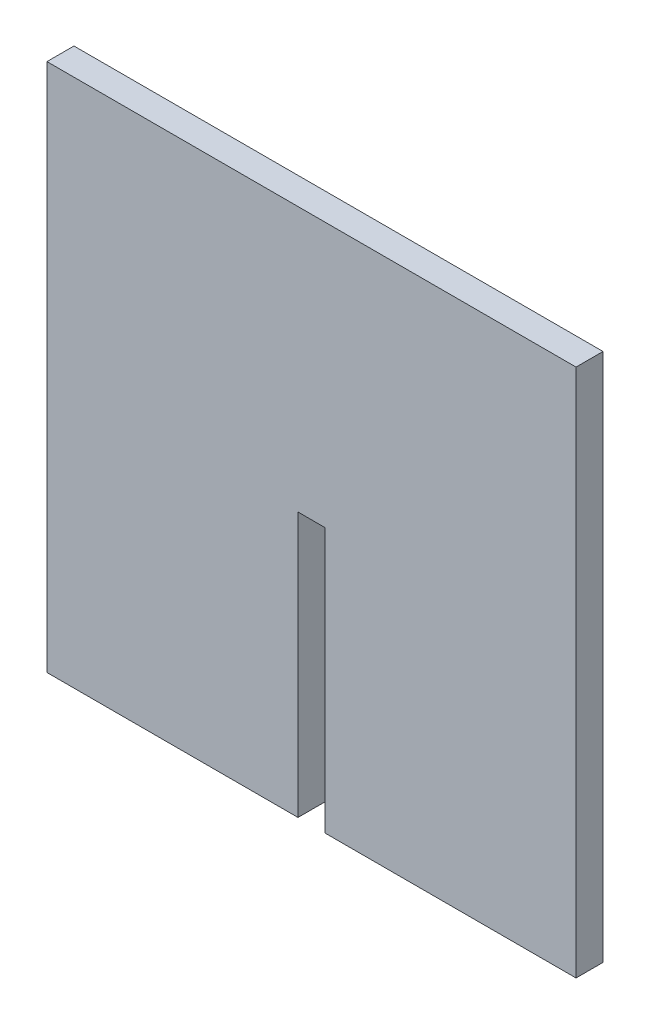
ISO-10303-21;
HEADER;
FILE_DESCRIPTION(('STEP AP214'),'2;1');
FILE_NAME('part.step','',(''),(''),'','','');
FILE_SCHEMA(('AUTOMOTIVE_DESIGN { 1 0 10303 214 1 1 1 1 }'));
ENDSEC;
DATA;
#1=APPLICATION_CONTEXT('core data for automotive mechanical design processes');
#2=APPLICATION_PROTOCOL_DEFINITION('international standard','automotive_design',2000,#1);
#3=PRODUCT_CONTEXT('',#1,'mechanical');
#4=PRODUCT('Part','Part','',(#3));
#5=PRODUCT_RELATED_PRODUCT_CATEGORY('part','',(#4));
#6=PRODUCT_DEFINITION_FORMATION('','',#4);
#7=PRODUCT_DEFINITION_CONTEXT('part definition',#1,'design');
#8=PRODUCT_DEFINITION('design','',#6,#7);
#9=PRODUCT_DEFINITION_SHAPE('','',#8);
#10=(LENGTH_UNIT() NAMED_UNIT(*) SI_UNIT(.MILLI.,.METRE.));
#11=(NAMED_UNIT(*) PLANE_ANGLE_UNIT() SI_UNIT($,.RADIAN.));
#12=(NAMED_UNIT(*) SI_UNIT($,.STERADIAN.) SOLID_ANGLE_UNIT());
#13=UNCERTAINTY_MEASURE_WITH_UNIT(LENGTH_MEASURE(1.E-05),#10,'distance_accuracy_value','');
#14=(GEOMETRIC_REPRESENTATION_CONTEXT(3) GLOBAL_UNCERTAINTY_ASSIGNED_CONTEXT((#13)) GLOBAL_UNIT_ASSIGNED_CONTEXT((#10,
#11,#12)) REPRESENTATION_CONTEXT('',''));
#15=CARTESIAN_POINT('',(0.,0.,0.));
#16=DIRECTION('',(0.,0.,1.));
#17=DIRECTION('',(1.,0.,0.));
#18=AXIS2_PLACEMENT_3D('',#15,#16,#17);
#19=CARTESIAN_POINT('',(0.,0.,4.318));
#20=DIRECTION('',(1.,0.,0.));
#21=DIRECTION('',(0.,0.,-1.));
#22=AXIS2_PLACEMENT_3D('',#19,#20,#21);
#23=PLANE('',#22);
#24=DIRECTION('',(0.,-1.,0.));
#25=VECTOR('',#24,1.);
#26=CARTESIAN_POINT('',(0.,0.,0.));
#27=LINE('',#26,#25);
#28=CARTESIAN_POINT('',(0.,84.6,0.));
#29=VERTEX_POINT('',#28);
#30=CARTESIAN_POINT('',(0.,0.,0.));
#31=VERTEX_POINT('',#30);
#32=EDGE_CURVE('E129',#29,#31,#27,.T.);
#33=ORIENTED_EDGE('',*,*,#32,.T.);
#34=DIRECTION('',(0.,0.,-1.));
#35=VECTOR('',#34,1.);
#36=CARTESIAN_POINT('',(0.,0.,4.318));
#37=LINE('',#36,#35);
#38=CARTESIAN_POINT('',(0.,0.,4.318));
#39=VERTEX_POINT('',#38);
#40=EDGE_CURVE('E11',#39,#31,#37,.T.);
#41=ORIENTED_EDGE('',*,*,#40,.F.);
#42=DIRECTION('',(0.,-1.,0.));
#43=VECTOR('',#42,1.);
#44=CARTESIAN_POINT('',(0.,0.,4.318));
#45=LINE('',#44,#43);
#46=CARTESIAN_POINT('',(0.,84.6,4.318));
#47=VERTEX_POINT('',#46);
#48=EDGE_CURVE('E143',#47,#39,#45,.T.);
#49=ORIENTED_EDGE('',*,*,#48,.F.);
#50=DIRECTION('',(0.,0.,-1.));
#51=VECTOR('',#50,1.);
#52=CARTESIAN_POINT('',(0.,84.6,4.318));
#53=LINE('',#52,#51);
#54=EDGE_CURVE('E125',#47,#29,#53,.T.);
#55=ORIENTED_EDGE('',*,*,#54,.T.);
#56=EDGE_LOOP('',(#33,#41,#49,#55));
#57=FACE_BOUND('',#56,.T.);
#58=ADVANCED_FACE('F33',(#57),#23,.F.);
#59=CARTESIAN_POINT('',(0.,0.,4.318));
#60=DIRECTION('',(0.,1.,0.));
#61=DIRECTION('',(0.,0.,1.));
#62=AXIS2_PLACEMENT_3D('',#59,#60,#61);
#63=PLANE('',#62);
#64=DIRECTION('',(1.,0.,0.));
#65=VECTOR('',#64,1.);
#66=CARTESIAN_POINT('',(0.,0.,0.));
#67=LINE('',#66,#65);
#68=CARTESIAN_POINT('',(40.141,0.,0.));
#69=VERTEX_POINT('',#68);
#70=EDGE_CURVE('E132',#31,#69,#67,.T.);
#71=ORIENTED_EDGE('',*,*,#70,.T.);
#72=DIRECTION('',(0.,0.,-1.));
#73=VECTOR('',#72,1.);
#74=CARTESIAN_POINT('',(40.141,0.,4.318));
#75=LINE('',#74,#73);
#76=CARTESIAN_POINT('',(40.141,0.,4.318));
#77=VERTEX_POINT('',#76);
#78=EDGE_CURVE('E41',#77,#69,#75,.T.);
#79=ORIENTED_EDGE('',*,*,#78,.F.);
#80=DIRECTION('',(1.,0.,0.));
#81=VECTOR('',#80,1.);
#82=CARTESIAN_POINT('',(0.,0.,4.318));
#83=LINE('',#82,#81);
#84=EDGE_CURVE('E92',#39,#77,#83,.T.);
#85=ORIENTED_EDGE('',*,*,#84,.F.);
#86=ORIENTED_EDGE('',*,*,#40,.T.);
#87=EDGE_LOOP('',(#71,#79,#85,#86));
#88=FACE_BOUND('',#87,.T.);
#89=ADVANCED_FACE('F178',(#88),#63,.F.);
#90=CARTESIAN_POINT('',(40.141,0.,4.318));
#91=DIRECTION('',(-1.,0.,0.));
#92=DIRECTION('',(0.,0.,1.));
#93=AXIS2_PLACEMENT_3D('',#90,#91,#92);
#94=PLANE('',#93);
#95=DIRECTION('',(0.,1.,0.));
#96=VECTOR('',#95,1.);
#97=CARTESIAN_POINT('',(40.141,0.,0.));
#98=LINE('',#97,#96);
#99=CARTESIAN_POINT('',(40.141,42.3,0.));
#100=VERTEX_POINT('',#99);
#101=EDGE_CURVE('E134',#69,#100,#98,.T.);
#102=ORIENTED_EDGE('',*,*,#101,.T.);
#103=DIRECTION('',(0.,0.,-1.));
#104=VECTOR('',#103,1.);
#105=CARTESIAN_POINT('',(40.141,42.3,4.318));
#106=LINE('',#105,#104);
#107=CARTESIAN_POINT('',(40.141,42.3,4.318));
#108=VERTEX_POINT('',#107);
#109=EDGE_CURVE('E150',#108,#100,#106,.T.);
#110=ORIENTED_EDGE('',*,*,#109,.F.);
#111=DIRECTION('',(0.,1.,0.));
#112=VECTOR('',#111,1.);
#113=CARTESIAN_POINT('',(40.141,0.,4.318));
#114=LINE('',#113,#112);
#115=EDGE_CURVE('E158',#77,#108,#114,.T.);
#116=ORIENTED_EDGE('',*,*,#115,.F.);
#117=ORIENTED_EDGE('',*,*,#78,.T.);
#118=EDGE_LOOP('',(#102,#110,#116,#117));
#119=FACE_BOUND('',#118,.T.);
#120=ADVANCED_FACE('F156',(#119),#94,.F.);
#121=CARTESIAN_POINT('',(40.141,42.3,4.318));
#122=DIRECTION('',(0.,1.,0.));
#123=DIRECTION('',(0.,0.,1.));
#124=AXIS2_PLACEMENT_3D('',#121,#122,#123);
#125=PLANE('',#124);
#126=DIRECTION('',(1.,0.,0.));
#127=VECTOR('',#126,1.);
#128=CARTESIAN_POINT('',(40.141,42.3,0.));
#129=LINE('',#128,#127);
#130=CARTESIAN_POINT('',(44.459,42.3,0.));
#131=VERTEX_POINT('',#130);
#132=EDGE_CURVE('E136',#100,#131,#129,.T.);
#133=ORIENTED_EDGE('',*,*,#132,.T.);
#134=DIRECTION('',(0.,0.,-1.));
#135=VECTOR('',#134,1.);
#136=CARTESIAN_POINT('',(44.459,42.3,4.318));
#137=LINE('',#136,#135);
#138=CARTESIAN_POINT('',(44.459,42.3,4.318));
#139=VERTEX_POINT('',#138);
#140=EDGE_CURVE('E147',#139,#131,#137,.T.);
#141=ORIENTED_EDGE('',*,*,#140,.F.);
#142=DIRECTION('',(1.,0.,0.));
#143=VECTOR('',#142,1.);
#144=CARTESIAN_POINT('',(40.141,42.3,4.318));
#145=LINE('',#144,#143);
#146=EDGE_CURVE('E170',#108,#139,#145,.T.);
#147=ORIENTED_EDGE('',*,*,#146,.F.);
#148=ORIENTED_EDGE('',*,*,#109,.T.);
#149=EDGE_LOOP('',(#133,#141,#147,#148));
#150=FACE_BOUND('',#149,.T.);
#151=ADVANCED_FACE('F166',(#150),#125,.F.);
#152=CARTESIAN_POINT('',(44.459,0.,4.318));
#153=DIRECTION('',(1.,0.,0.));
#154=DIRECTION('',(0.,0.,-1.));
#155=AXIS2_PLACEMENT_3D('',#152,#153,#154);
#156=PLANE('',#155);
#157=DIRECTION('',(0.,-1.,0.));
#158=VECTOR('',#157,1.);
#159=CARTESIAN_POINT('',(44.459,0.,0.));
#160=LINE('',#159,#158);
#161=CARTESIAN_POINT('',(44.459,0.,0.));
#162=VERTEX_POINT('',#161);
#163=EDGE_CURVE('E138',#131,#162,#160,.T.);
#164=ORIENTED_EDGE('',*,*,#163,.T.);
#165=DIRECTION('',(0.,0.,-1.));
#166=VECTOR('',#165,1.);
#167=CARTESIAN_POINT('',(44.459,0.,4.318));
#168=LINE('',#167,#166);
#169=CARTESIAN_POINT('',(44.459,0.,4.318));
#170=VERTEX_POINT('',#169);
#171=EDGE_CURVE('E120',#170,#162,#168,.T.);
#172=ORIENTED_EDGE('',*,*,#171,.F.);
#173=DIRECTION('',(0.,-1.,0.));
#174=VECTOR('',#173,1.);
#175=CARTESIAN_POINT('',(44.459,0.,4.318));
#176=LINE('',#175,#174);
#177=EDGE_CURVE('E111',#139,#170,#176,.T.);
#178=ORIENTED_EDGE('',*,*,#177,.F.);
#179=ORIENTED_EDGE('',*,*,#140,.T.);
#180=EDGE_LOOP('',(#164,#172,#178,#179));
#181=FACE_BOUND('',#180,.T.);
#182=ADVANCED_FACE('F169',(#181),#156,.F.);
#183=CARTESIAN_POINT('',(44.459,0.,4.318));
#184=DIRECTION('',(0.,1.,0.));
#185=DIRECTION('',(0.,0.,1.));
#186=AXIS2_PLACEMENT_3D('',#183,#184,#185);
#187=PLANE('',#186);
#188=DIRECTION('',(1.,0.,0.));
#189=VECTOR('',#188,1.);
#190=CARTESIAN_POINT('',(44.459,0.,0.));
#191=LINE('',#190,#189);
#192=CARTESIAN_POINT('',(84.6,0.,0.));
#193=VERTEX_POINT('',#192);
#194=EDGE_CURVE('E119',#162,#193,#191,.T.);
#195=ORIENTED_EDGE('',*,*,#194,.T.);
#196=DIRECTION('',(0.,0.,-1.));
#197=VECTOR('',#196,1.);
#198=CARTESIAN_POINT('',(84.6,0.,4.318));
#199=LINE('',#198,#197);
#200=CARTESIAN_POINT('',(84.6,0.,4.318));
#201=VERTEX_POINT('',#200);
#202=EDGE_CURVE('E116',#201,#193,#199,.T.);
#203=ORIENTED_EDGE('',*,*,#202,.F.);
#204=DIRECTION('',(1.,0.,0.));
#205=VECTOR('',#204,1.);
#206=CARTESIAN_POINT('',(44.459,0.,4.318));
#207=LINE('',#206,#205);
#208=EDGE_CURVE('E105',#170,#201,#207,.T.);
#209=ORIENTED_EDGE('',*,*,#208,.F.);
#210=ORIENTED_EDGE('',*,*,#171,.T.);
#211=EDGE_LOOP('',(#195,#203,#209,#210));
#212=FACE_BOUND('',#211,.T.);
#213=ADVANCED_FACE('F117',(#212),#187,.F.);
#214=CARTESIAN_POINT('',(84.6,0.,4.318));
#215=DIRECTION('',(-1.,0.,0.));
#216=DIRECTION('',(0.,0.,1.));
#217=AXIS2_PLACEMENT_3D('',#214,#215,#216);
#218=PLANE('',#217);
#219=DIRECTION('',(0.,1.,0.));
#220=VECTOR('',#219,1.);
#221=CARTESIAN_POINT('',(84.6,0.,0.));
#222=LINE('',#221,#220);
#223=CARTESIAN_POINT('',(84.6,84.6,0.));
#224=VERTEX_POINT('',#223);
#225=EDGE_CURVE('E78',#193,#224,#222,.T.);
#226=ORIENTED_EDGE('',*,*,#225,.T.);
#227=DIRECTION('',(0.,0.,-1.));
#228=VECTOR('',#227,1.);
#229=CARTESIAN_POINT('',(84.6,84.6,4.318));
#230=LINE('',#229,#228);
#231=CARTESIAN_POINT('',(84.6,84.6,4.318));
#232=VERTEX_POINT('',#231);
#233=EDGE_CURVE('E121',#232,#224,#230,.T.);
#234=ORIENTED_EDGE('',*,*,#233,.F.);
#235=DIRECTION('',(0.,1.,0.));
#236=VECTOR('',#235,1.);
#237=CARTESIAN_POINT('',(84.6,0.,4.318));
#238=LINE('',#237,#236);
#239=EDGE_CURVE('E109',#201,#232,#238,.T.);
#240=ORIENTED_EDGE('',*,*,#239,.F.);
#241=ORIENTED_EDGE('',*,*,#202,.T.);
#242=EDGE_LOOP('',(#226,#234,#240,#241));
#243=FACE_BOUND('',#242,.T.);
#244=ADVANCED_FACE('F123',(#243),#218,.F.);
#245=CARTESIAN_POINT('',(0.,84.6,4.318));
#246=DIRECTION('',(0.,-1.,0.));
#247=DIRECTION('',(0.,0.,-1.));
#248=AXIS2_PLACEMENT_3D('',#245,#246,#247);
#249=PLANE('',#248);
#250=DIRECTION('',(-1.,0.,0.));
#251=VECTOR('',#250,1.);
#252=CARTESIAN_POINT('',(0.,84.6,0.));
#253=LINE('',#252,#251);
#254=EDGE_CURVE('E84',#224,#29,#253,.T.);
#255=ORIENTED_EDGE('',*,*,#254,.T.);
#256=ORIENTED_EDGE('',*,*,#54,.F.);
#257=DIRECTION('',(-1.,0.,0.));
#258=VECTOR('',#257,1.);
#259=CARTESIAN_POINT('',(0.,84.6,4.318));
#260=LINE('',#259,#258);
#261=EDGE_CURVE('E49',#232,#47,#260,.T.);
#262=ORIENTED_EDGE('',*,*,#261,.F.);
#263=ORIENTED_EDGE('',*,*,#233,.T.);
#264=EDGE_LOOP('',(#255,#256,#262,#263));
#265=FACE_BOUND('',#264,.T.);
#266=ADVANCED_FACE('F194',(#265),#249,.F.);
#267=CARTESIAN_POINT('',(0.,84.6,4.318));
#268=DIRECTION('',(0.,0.,-1.));
#269=DIRECTION('',(-1.,0.,0.));
#270=AXIS2_PLACEMENT_3D('',#267,#268,#269);
#271=PLANE('',#270);
#272=ORIENTED_EDGE('',*,*,#48,.T.);
#273=ORIENTED_EDGE('',*,*,#84,.T.);
#274=ORIENTED_EDGE('',*,*,#115,.T.);
#275=ORIENTED_EDGE('',*,*,#146,.T.);
#276=ORIENTED_EDGE('',*,*,#177,.T.);
#277=ORIENTED_EDGE('',*,*,#208,.T.);
#278=ORIENTED_EDGE('',*,*,#239,.T.);
#279=ORIENTED_EDGE('',*,*,#261,.T.);
#280=EDGE_LOOP('',(#272,#273,#274,#275,#276,#277,#278,#279));
#281=FACE_BOUND('',#280,.T.);
#282=ADVANCED_FACE('F107',(#281),#271,.F.);
#283=CARTESIAN_POINT('',(0.,84.6,0.));
#284=DIRECTION('',(0.,0.,-1.));
#285=DIRECTION('',(-1.,0.,0.));
#286=AXIS2_PLACEMENT_3D('',#283,#284,#285);
#287=PLANE('',#286);
#288=ORIENTED_EDGE('',*,*,#32,.F.);
#289=ORIENTED_EDGE('',*,*,#254,.F.);
#290=ORIENTED_EDGE('',*,*,#225,.F.);
#291=ORIENTED_EDGE('',*,*,#194,.F.);
#292=ORIENTED_EDGE('',*,*,#163,.F.);
#293=ORIENTED_EDGE('',*,*,#132,.F.);
#294=ORIENTED_EDGE('',*,*,#101,.F.);
#295=ORIENTED_EDGE('',*,*,#70,.F.);
#296=EDGE_LOOP('',(#288,#289,#290,#291,#292,#293,#294,#295));
#297=FACE_BOUND('',#296,.T.);
#298=ADVANCED_FACE('F162',(#297),#287,.T.);
#299=CLOSED_SHELL('',(#58,#89,#120,#151,#182,#213,#244,#266,#282,#298));
#300=MANIFOLD_SOLID_BREP('B2',#299);
#301=ADVANCED_BREP_SHAPE_REPRESENTATION('',(#18,#300),#14);
#302=SHAPE_DEFINITION_REPRESENTATION(#9,#301);
ENDSEC;
END-ISO-10303-21;
